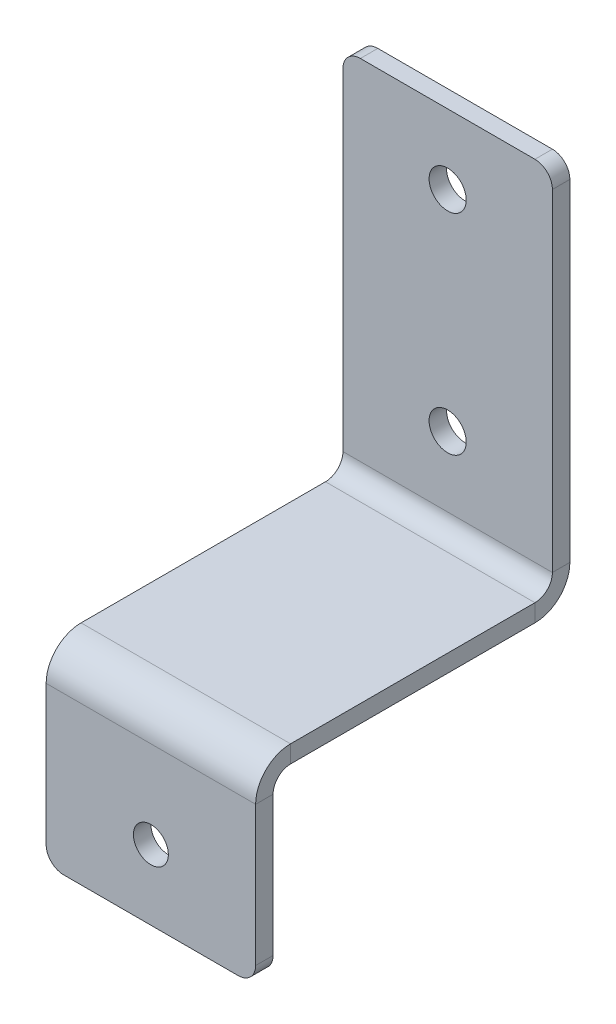
ISO-10303-21;
HEADER;
FILE_DESCRIPTION(('STEP AP214'),'2;1');
FILE_NAME('part.step','',(''),(''),'','','');
FILE_SCHEMA(('AUTOMOTIVE_DESIGN { 1 0 10303 214 1 1 1 1 }'));
ENDSEC;
DATA;
#1=APPLICATION_CONTEXT('core data for automotive mechanical design processes');
#2=APPLICATION_PROTOCOL_DEFINITION('international standard','automotive_design',2000,#1);
#3=PRODUCT_CONTEXT('',#1,'mechanical');
#4=PRODUCT('Part','Part','',(#3));
#5=PRODUCT_RELATED_PRODUCT_CATEGORY('part','',(#4));
#6=PRODUCT_DEFINITION_FORMATION('','',#4);
#7=PRODUCT_DEFINITION_CONTEXT('part definition',#1,'design');
#8=PRODUCT_DEFINITION('design','',#6,#7);
#9=PRODUCT_DEFINITION_SHAPE('','',#8);
#10=(LENGTH_UNIT() NAMED_UNIT(*) SI_UNIT(.MILLI.,.METRE.));
#11=(NAMED_UNIT(*) PLANE_ANGLE_UNIT() SI_UNIT($,.RADIAN.));
#12=(NAMED_UNIT(*) SI_UNIT($,.STERADIAN.) SOLID_ANGLE_UNIT());
#13=UNCERTAINTY_MEASURE_WITH_UNIT(LENGTH_MEASURE(1.E-05),#10,'distance_accuracy_value','');
#14=(GEOMETRIC_REPRESENTATION_CONTEXT(3) GLOBAL_UNCERTAINTY_ASSIGNED_CONTEXT((#13)) GLOBAL_UNIT_ASSIGNED_CONTEXT((#10,
#11,#12)) REPRESENTATION_CONTEXT('',''));
#15=CARTESIAN_POINT('',(0.,0.,0.));
#16=DIRECTION('',(0.,0.,1.));
#17=DIRECTION('',(1.,0.,0.));
#18=AXIS2_PLACEMENT_3D('',#15,#16,#17);
#19=CARTESIAN_POINT('',(0.,-3.175,0.));
#20=DIRECTION('',(-1.,0.,0.));
#21=DIRECTION('',(0.,0.,1.));
#22=AXIS2_PLACEMENT_3D('',#19,#20,#21);
#23=PLANE('',#22);
#24=DIRECTION('',(0.,0.,1.));
#25=VECTOR('',#24,1.);
#26=CARTESIAN_POINT('',(0.,-3.175,0.));
#27=LINE('',#26,#25);
#28=CARTESIAN_POINT('',(0.,-3.17500000000003,-50.8));
#29=VERTEX_POINT('',#28);
#30=CARTESIAN_POINT('',(0.,-3.175,-6.34999999999999));
#31=VERTEX_POINT('',#30);
#32=EDGE_CURVE('E311',#29,#31,#27,.T.);
#33=ORIENTED_EDGE('',*,*,#32,.T.);
#34=DIRECTION('',(0.,1.,0.));
#35=VECTOR('',#34,1.);
#36=CARTESIAN_POINT('',(0.,-3.17499999999999,-6.34999999999999));
#37=LINE('',#36,#35);
#38=CARTESIAN_POINT('',(0.,0.,-6.34999999999999));
#39=VERTEX_POINT('',#38);
#40=EDGE_CURVE('E250',#31,#39,#37,.T.);
#41=ORIENTED_EDGE('',*,*,#40,.T.);
#42=DIRECTION('',(0.,0.,1.));
#43=VECTOR('',#42,1.);
#44=CARTESIAN_POINT('',(0.,0.,0.));
#45=LINE('',#44,#43);
#46=CARTESIAN_POINT('',(0.,0.,-50.8));
#47=VERTEX_POINT('',#46);
#48=EDGE_CURVE('E308',#47,#39,#45,.T.);
#49=ORIENTED_EDGE('',*,*,#48,.F.);
#50=DIRECTION('',(0.,-1.,0.));
#51=VECTOR('',#50,1.);
#52=CARTESIAN_POINT('',(0.,0.,-50.8));
#53=LINE('',#52,#51);
#54=EDGE_CURVE('E294',#47,#29,#53,.T.);
#55=ORIENTED_EDGE('',*,*,#54,.T.);
#56=EDGE_LOOP('',(#33,#41,#49,#55));
#57=FACE_BOUND('',#56,.T.);
#58=ADVANCED_FACE('F78',(#57),#23,.T.);
#59=CARTESIAN_POINT('',(0.,-3.175,0.));
#60=DIRECTION('',(0.,-1.,0.));
#61=DIRECTION('',(0.,0.,-1.));
#62=AXIS2_PLACEMENT_3D('',#59,#60,#61);
#63=PLANE('',#62);
#64=DIRECTION('',(0.,0.,-1.));
#65=VECTOR('',#64,1.);
#66=CARTESIAN_POINT('',(38.1,-3.175,0.));
#67=LINE('',#66,#65);
#68=CARTESIAN_POINT('',(38.1,-3.175,-6.34999999999998));
#69=VERTEX_POINT('',#68);
#70=CARTESIAN_POINT('',(38.1,-3.175,-50.8));
#71=VERTEX_POINT('',#70);
#72=EDGE_CURVE('E314',#69,#71,#67,.T.);
#73=ORIENTED_EDGE('',*,*,#72,.F.);
#74=DIRECTION('',(-1.,0.,0.));
#75=VECTOR('',#74,1.);
#76=CARTESIAN_POINT('',(0.,-3.17499999999999,-6.34999999999999));
#77=LINE('',#76,#75);
#78=EDGE_CURVE('E254',#31,#69,#77,.F.);
#79=ORIENTED_EDGE('',*,*,#78,.F.);
#80=ORIENTED_EDGE('',*,*,#32,.F.);
#81=DIRECTION('',(-1.,0.,0.));
#82=VECTOR('',#81,1.);
#83=CARTESIAN_POINT('',(0.,-3.17500000000003,-50.8));
#84=LINE('',#83,#82);
#85=EDGE_CURVE('E287',#29,#71,#84,.F.);
#86=ORIENTED_EDGE('',*,*,#85,.T.);
#87=EDGE_LOOP('',(#73,#79,#80,#86));
#88=FACE_BOUND('',#87,.T.);
#89=ADVANCED_FACE('F390',(#88),#63,.T.);
#90=CARTESIAN_POINT('',(0.,0.,0.));
#91=DIRECTION('',(0.,-1.,0.));
#92=DIRECTION('',(0.,0.,-1.));
#93=AXIS2_PLACEMENT_3D('',#90,#91,#92);
#94=PLANE('',#93);
#95=DIRECTION('',(-1.,0.,0.));
#96=VECTOR('',#95,1.);
#97=CARTESIAN_POINT('',(0.,0.,-6.34999999999999));
#98=LINE('',#97,#96);
#99=CARTESIAN_POINT('',(38.1,0.,-6.34999999999998));
#100=VERTEX_POINT('',#99);
#101=EDGE_CURVE('E202',#39,#100,#98,.F.);
#102=ORIENTED_EDGE('',*,*,#101,.T.);
#103=DIRECTION('',(0.,0.,-1.));
#104=VECTOR('',#103,1.);
#105=CARTESIAN_POINT('',(38.1,0.,0.));
#106=LINE('',#105,#104);
#107=CARTESIAN_POINT('',(38.1,0.,-50.8));
#108=VERTEX_POINT('',#107);
#109=EDGE_CURVE('E315',#100,#108,#106,.T.);
#110=ORIENTED_EDGE('',*,*,#109,.T.);
#111=DIRECTION('',(-1.,0.,0.));
#112=VECTOR('',#111,1.);
#113=CARTESIAN_POINT('',(0.,0.,-50.8));
#114=LINE('',#113,#112);
#115=EDGE_CURVE('E300',#47,#108,#114,.F.);
#116=ORIENTED_EDGE('',*,*,#115,.F.);
#117=ORIENTED_EDGE('',*,*,#48,.T.);
#118=EDGE_LOOP('',(#102,#110,#116,#117));
#119=FACE_BOUND('',#118,.T.);
#120=ADVANCED_FACE('F446',(#119),#94,.F.);
#121=CARTESIAN_POINT('',(38.1,-3.175,0.));
#122=DIRECTION('',(1.,0.,0.));
#123=DIRECTION('',(0.,0.,-1.));
#124=AXIS2_PLACEMENT_3D('',#121,#122,#123);
#125=PLANE('',#124);
#126=DIRECTION('',(0.,1.,0.));
#127=VECTOR('',#126,1.);
#128=CARTESIAN_POINT('',(38.1,-3.17499999999999,-6.34999999999998));
#129=LINE('',#128,#127);
#130=EDGE_CURVE('E258',#69,#100,#129,.T.);
#131=ORIENTED_EDGE('',*,*,#130,.F.);
#132=ORIENTED_EDGE('',*,*,#72,.T.);
#133=DIRECTION('',(0.,-1.,0.));
#134=VECTOR('',#133,1.);
#135=CARTESIAN_POINT('',(38.1,0.,-50.8));
#136=LINE('',#135,#134);
#137=EDGE_CURVE('E305',#108,#71,#136,.T.);
#138=ORIENTED_EDGE('',*,*,#137,.F.);
#139=ORIENTED_EDGE('',*,*,#109,.F.);
#140=EDGE_LOOP('',(#131,#132,#138,#139));
#141=FACE_BOUND('',#140,.T.);
#142=ADVANCED_FACE('F450',(#141),#125,.T.);
#143=CARTESIAN_POINT('',(38.1,3.17499999999997,-50.8));
#144=DIRECTION('',(1.,0.,0.));
#145=DIRECTION('',(0.,0.,-1.));
#146=AXIS2_PLACEMENT_3D('',#143,#144,#145);
#147=PLANE('',#146);
#148=DIRECTION('',(0.,0.,1.));
#149=VECTOR('',#148,1.);
#150=CARTESIAN_POINT('',(38.1,3.17500000000001,-57.15));
#151=LINE('',#150,#149);
#152=CARTESIAN_POINT('',(38.1,3.17499999999996,-53.975));
#153=VERTEX_POINT('',#152);
#154=CARTESIAN_POINT('',(38.1,3.17499999999995,-57.15));
#155=VERTEX_POINT('',#154);
#156=EDGE_CURVE('E261',#153,#155,#151,.F.);
#157=ORIENTED_EDGE('',*,*,#156,.F.);
#158=CARTESIAN_POINT('',(38.1,3.17499999999997,-50.8));
#159=DIRECTION('',(-1.,0.,0.));
#160=DIRECTION('',(0.,0.,1.));
#161=AXIS2_PLACEMENT_3D('',#158,#159,#160);
#162=CIRCLE('',#161,3.175);
#163=EDGE_CURVE('E297',#108,#153,#162,.F.);
#164=ORIENTED_EDGE('',*,*,#163,.F.);
#165=ORIENTED_EDGE('',*,*,#137,.T.);
#166=CARTESIAN_POINT('',(38.1,3.17499999999997,-50.8));
#167=DIRECTION('',(-1.,0.,0.));
#168=DIRECTION('',(0.,0.,1.));
#169=AXIS2_PLACEMENT_3D('',#166,#167,#168);
#170=CIRCLE('',#169,6.35);
#171=EDGE_CURVE('E290',#71,#155,#170,.F.);
#172=ORIENTED_EDGE('',*,*,#171,.T.);
#173=EDGE_LOOP('',(#157,#164,#165,#172));
#174=FACE_BOUND('',#173,.T.);
#175=ADVANCED_FACE('F383',(#174),#147,.T.);
#176=CARTESIAN_POINT('',(0.,3.17499999999997,-50.8));
#177=DIRECTION('',(1.,0.,0.));
#178=DIRECTION('',(0.,0.,-1.));
#179=AXIS2_PLACEMENT_3D('',#176,#177,#178);
#180=PLANE('',#179);
#181=CARTESIAN_POINT('',(0.,3.17499999999997,-50.8));
#182=DIRECTION('',(-1.,0.,0.));
#183=DIRECTION('',(0.,0.,1.));
#184=AXIS2_PLACEMENT_3D('',#181,#182,#183);
#185=CIRCLE('',#184,3.175);
#186=CARTESIAN_POINT('',(0.,3.17499999999996,-53.975));
#187=VERTEX_POINT('',#186);
#188=EDGE_CURVE('E266',#187,#47,#185,.T.);
#189=ORIENTED_EDGE('',*,*,#188,.F.);
#190=DIRECTION('',(0.,0.,1.));
#191=VECTOR('',#190,1.);
#192=CARTESIAN_POINT('',(0.,3.17499999999999,-53.975));
#193=LINE('',#192,#191);
#194=CARTESIAN_POINT('',(0.,3.17500000000001,-57.15));
#195=VERTEX_POINT('',#194);
#196=EDGE_CURVE('E280',#187,#195,#193,.F.);
#197=ORIENTED_EDGE('',*,*,#196,.T.);
#198=CARTESIAN_POINT('',(0.,3.17499999999997,-50.8));
#199=DIRECTION('',(-1.,0.,0.));
#200=DIRECTION('',(0.,0.,1.));
#201=AXIS2_PLACEMENT_3D('',#198,#199,#200);
#202=CIRCLE('',#201,6.35);
#203=EDGE_CURVE('E291',#195,#29,#202,.T.);
#204=ORIENTED_EDGE('',*,*,#203,.T.);
#205=ORIENTED_EDGE('',*,*,#54,.F.);
#206=EDGE_LOOP('',(#189,#197,#204,#205));
#207=FACE_BOUND('',#206,.T.);
#208=ADVANCED_FACE('F378',(#207),#180,.F.);
#209=CARTESIAN_POINT('',(0.,3.17499999999997,-50.8));
#210=DIRECTION('',(-1.,0.,0.));
#211=DIRECTION('',(0.,0.,-1.));
#212=AXIS2_PLACEMENT_3D('',#209,#210,#211);
#213=CYLINDRICAL_SURFACE('',#212,6.35);
#214=ORIENTED_EDGE('',*,*,#85,.F.);
#215=ORIENTED_EDGE('',*,*,#203,.F.);
#216=DIRECTION('',(-1.,0.,0.));
#217=VECTOR('',#216,1.);
#218=CARTESIAN_POINT('',(38.1,3.17500000000001,-57.15));
#219=LINE('',#218,#217);
#220=EDGE_CURVE('E277',#195,#155,#219,.F.);
#221=ORIENTED_EDGE('',*,*,#220,.T.);
#222=ORIENTED_EDGE('',*,*,#171,.F.);
#223=EDGE_LOOP('',(#214,#215,#221,#222));
#224=FACE_BOUND('',#223,.T.);
#225=ADVANCED_FACE('F381',(#224),#213,.T.);
#226=CARTESIAN_POINT('',(0.,3.17499999999997,-50.8));
#227=DIRECTION('',(-1.,0.,0.));
#228=DIRECTION('',(0.,0.,-1.));
#229=AXIS2_PLACEMENT_3D('',#226,#227,#228);
#230=CYLINDRICAL_SURFACE('',#229,3.175);
#231=ORIENTED_EDGE('',*,*,#115,.T.);
#232=ORIENTED_EDGE('',*,*,#163,.T.);
#233=DIRECTION('',(-1.,0.,0.));
#234=VECTOR('',#233,1.);
#235=CARTESIAN_POINT('',(38.1,3.17499999999999,-53.975));
#236=LINE('',#235,#234);
#237=EDGE_CURVE('E283',#153,#187,#236,.T.);
#238=ORIENTED_EDGE('',*,*,#237,.T.);
#239=ORIENTED_EDGE('',*,*,#188,.T.);
#240=EDGE_LOOP('',(#231,#232,#238,#239));
#241=FACE_BOUND('',#240,.T.);
#242=ADVANCED_FACE('F575',(#241),#230,.F.);
#243=CARTESIAN_POINT('',(38.1,0.,-57.15));
#244=DIRECTION('',(-1.,0.,0.));
#245=DIRECTION('',(0.,0.,1.));
#246=AXIS2_PLACEMENT_3D('',#243,#244,#245);
#247=PLANE('',#246);
#248=DIRECTION('',(0.,-1.,0.));
#249=VECTOR('',#248,1.);
#250=CARTESIAN_POINT('',(38.1,-2.13304647021838E-13,-57.15));
#251=LINE('',#250,#249);
#252=CARTESIAN_POINT('',(38.1,63.5,-57.1500000000002));
#253=VERTEX_POINT('',#252);
#254=EDGE_CURVE('E269',#253,#155,#251,.T.);
#255=ORIENTED_EDGE('',*,*,#254,.F.);
#256=DIRECTION('',(0.,0.,1.));
#257=VECTOR('',#256,1.);
#258=CARTESIAN_POINT('',(38.1,63.5,-57.1500000000002));
#259=LINE('',#258,#257);
#260=CARTESIAN_POINT('',(38.1,63.5,-53.9750000000002));
#261=VERTEX_POINT('',#260);
#262=EDGE_CURVE('E341',#253,#261,#259,.T.);
#263=ORIENTED_EDGE('',*,*,#262,.T.);
#264=DIRECTION('',(0.,1.,0.));
#265=VECTOR('',#264,1.);
#266=CARTESIAN_POINT('',(38.1,0.,-53.975));
#267=LINE('',#266,#265);
#268=EDGE_CURVE('E275',#261,#153,#267,.F.);
#269=ORIENTED_EDGE('',*,*,#268,.T.);
#270=ORIENTED_EDGE('',*,*,#156,.T.);
#271=EDGE_LOOP('',(#255,#263,#269,#270));
#272=FACE_BOUND('',#271,.T.);
#273=ADVANCED_FACE('F361',(#272),#247,.F.);
#274=CARTESIAN_POINT('',(0.,66.675,-57.1500000000002));
#275=DIRECTION('',(1.,0.,0.));
#276=DIRECTION('',(0.,0.,-1.));
#277=AXIS2_PLACEMENT_3D('',#274,#275,#276);
#278=PLANE('',#277);
#279=DIRECTION('',(0.,-1.,0.));
#280=VECTOR('',#279,1.);
#281=CARTESIAN_POINT('',(0.,66.675,-53.9750000000002));
#282=LINE('',#281,#280);
#283=CARTESIAN_POINT('',(0.,63.5,-53.9750000000002));
#284=VERTEX_POINT('',#283);
#285=EDGE_CURVE('E273',#187,#284,#282,.F.);
#286=ORIENTED_EDGE('',*,*,#285,.T.);
#287=DIRECTION('',(0.,0.,1.));
#288=VECTOR('',#287,1.);
#289=CARTESIAN_POINT('',(0.,63.5,-57.1500000000002));
#290=LINE('',#289,#288);
#291=CARTESIAN_POINT('',(0.,63.5,-57.1500000000002));
#292=VERTEX_POINT('',#291);
#293=EDGE_CURVE('E13',#284,#292,#290,.F.);
#294=ORIENTED_EDGE('',*,*,#293,.T.);
#295=DIRECTION('',(0.,1.,0.));
#296=VECTOR('',#295,1.);
#297=CARTESIAN_POINT('',(0.,-2.13304647021838E-13,-57.15));
#298=LINE('',#297,#296);
#299=EDGE_CURVE('E267',#195,#292,#298,.T.);
#300=ORIENTED_EDGE('',*,*,#299,.F.);
#301=ORIENTED_EDGE('',*,*,#196,.F.);
#302=EDGE_LOOP('',(#286,#294,#300,#301));
#303=FACE_BOUND('',#302,.T.);
#304=ADVANCED_FACE('F375',(#303),#278,.F.);
#305=CARTESIAN_POINT('',(0.,-2.13304647021838E-13,-57.15));
#306=DIRECTION('',(0.,0.,1.));
#307=DIRECTION('',(0.,-1.,0.));
#308=AXIS2_PLACEMENT_3D('',#305,#306,#307);
#309=PLANE('',#308);
#310=CARTESIAN_POINT('',(19.05,53.975,-57.1500000000002));
#311=DIRECTION('',(0.,0.,1.));
#312=DIRECTION('',(1.,0.,0.));
#313=AXIS2_PLACEMENT_3D('',#310,#311,#312);
#314=CIRCLE('',#313,3.37819999999999);
#315=CARTESIAN_POINT('',(22.4282,53.975,-57.1500000000002));
#316=VERTEX_POINT('',#315);
#317=EDGE_CURVE('E421',#316,#316,#314,.T.);
#318=ORIENTED_EDGE('',*,*,#317,.T.);
#319=EDGE_LOOP('',(#318));
#320=FACE_BOUND('',#319,.T.);
#321=CARTESIAN_POINT('',(19.05,15.875,-57.1500000000002));
#322=DIRECTION('',(0.,0.,1.));
#323=DIRECTION('',(1.,0.,0.));
#324=AXIS2_PLACEMENT_3D('',#321,#322,#323);
#325=CIRCLE('',#324,3.37819999999999);
#326=CARTESIAN_POINT('',(22.4282,15.875,-57.1500000000002));
#327=VERTEX_POINT('',#326);
#328=EDGE_CURVE('E247',#327,#327,#325,.T.);
#329=ORIENTED_EDGE('',*,*,#328,.T.);
#330=EDGE_LOOP('',(#329));
#331=FACE_BOUND('',#330,.T.);
#332=DIRECTION('',(1.,0.,0.));
#333=VECTOR('',#332,1.);
#334=CARTESIAN_POINT('',(0.,66.675,-57.1500000000002));
#335=LINE('',#334,#333);
#336=CARTESIAN_POINT('',(3.175,66.675,-57.1500000000002));
#337=VERTEX_POINT('',#336);
#338=CARTESIAN_POINT('',(34.925,66.675,-57.1500000000002));
#339=VERTEX_POINT('',#338);
#340=EDGE_CURVE('E264',#337,#339,#335,.T.);
#341=ORIENTED_EDGE('',*,*,#340,.T.);
#342=CARTESIAN_POINT('',(34.925,63.5,-57.1500000000002));
#343=DIRECTION('',(0.,0.,1.));
#344=DIRECTION('',(0.,-1.,0.));
#345=AXIS2_PLACEMENT_3D('',#342,#343,#344);
#346=CIRCLE('',#345,3.175);
#347=EDGE_CURVE('E86',#339,#253,#346,.F.);
#348=ORIENTED_EDGE('',*,*,#347,.T.);
#349=ORIENTED_EDGE('',*,*,#254,.T.);
#350=ORIENTED_EDGE('',*,*,#220,.F.);
#351=ORIENTED_EDGE('',*,*,#299,.T.);
#352=CARTESIAN_POINT('',(3.175,63.5,-57.1500000000002));
#353=DIRECTION('',(0.,0.,1.));
#354=DIRECTION('',(0.,-1.,0.));
#355=AXIS2_PLACEMENT_3D('',#352,#353,#354);
#356=CIRCLE('',#355,3.175);
#357=EDGE_CURVE('E352',#292,#337,#356,.F.);
#358=ORIENTED_EDGE('',*,*,#357,.T.);
#359=EDGE_LOOP('',(#341,#348,#349,#350,#351,#358));
#360=FACE_BOUND('',#359,.T.);
#361=ADVANCED_FACE('F356',(#320,#331,#360),#309,.F.);
#362=CARTESIAN_POINT('',(0.,-2.02219193771011E-13,-53.975));
#363=DIRECTION('',(0.,0.,1.));
#364=DIRECTION('',(0.,-1.,0.));
#365=AXIS2_PLACEMENT_3D('',#362,#363,#364);
#366=PLANE('',#365);
#367=CARTESIAN_POINT('',(19.05,53.975,-53.975));
#368=DIRECTION('',(0.,0.,1.));
#369=DIRECTION('',(1.,0.,0.));
#370=AXIS2_PLACEMENT_3D('',#367,#368,#369);
#371=CIRCLE('',#370,3.37819999999999);
#372=CARTESIAN_POINT('',(22.4282,53.975,-53.975));
#373=VERTEX_POINT('',#372);
#374=EDGE_CURVE('E323',#373,#373,#371,.T.);
#375=ORIENTED_EDGE('',*,*,#374,.F.);
#376=EDGE_LOOP('',(#375));
#377=FACE_BOUND('',#376,.T.);
#378=CARTESIAN_POINT('',(19.05,15.875,-53.975));
#379=DIRECTION('',(0.,0.,1.));
#380=DIRECTION('',(1.,0.,0.));
#381=AXIS2_PLACEMENT_3D('',#378,#379,#380);
#382=CIRCLE('',#381,3.37819999999999);
#383=CARTESIAN_POINT('',(22.4282,15.875,-53.975));
#384=VERTEX_POINT('',#383);
#385=EDGE_CURVE('E418',#384,#384,#382,.T.);
#386=ORIENTED_EDGE('',*,*,#385,.F.);
#387=EDGE_LOOP('',(#386));
#388=FACE_BOUND('',#387,.T.);
#389=ORIENTED_EDGE('',*,*,#268,.F.);
#390=CARTESIAN_POINT('',(34.925,63.5,-53.9750000000002));
#391=DIRECTION('',(0.,0.,1.));
#392=DIRECTION('',(0.,-1.,0.));
#393=AXIS2_PLACEMENT_3D('',#390,#391,#392);
#394=CIRCLE('',#393,3.175);
#395=CARTESIAN_POINT('',(34.925,66.675,-53.9750000000002));
#396=VERTEX_POINT('',#395);
#397=EDGE_CURVE('E346',#261,#396,#394,.T.);
#398=ORIENTED_EDGE('',*,*,#397,.T.);
#399=DIRECTION('',(-1.,0.,0.));
#400=VECTOR('',#399,1.);
#401=CARTESIAN_POINT('',(38.1,66.675,-53.9750000000002));
#402=LINE('',#401,#400);
#403=CARTESIAN_POINT('',(3.175,66.675,-53.9750000000002));
#404=VERTEX_POINT('',#403);
#405=EDGE_CURVE('E271',#404,#396,#402,.F.);
#406=ORIENTED_EDGE('',*,*,#405,.F.);
#407=CARTESIAN_POINT('',(3.175,63.5,-53.9750000000002));
#408=DIRECTION('',(0.,0.,1.));
#409=DIRECTION('',(0.,-1.,0.));
#410=AXIS2_PLACEMENT_3D('',#407,#408,#409);
#411=CIRCLE('',#410,3.175);
#412=EDGE_CURVE('E344',#404,#284,#411,.T.);
#413=ORIENTED_EDGE('',*,*,#412,.T.);
#414=ORIENTED_EDGE('',*,*,#285,.F.);
#415=ORIENTED_EDGE('',*,*,#237,.F.);
#416=EDGE_LOOP('',(#389,#398,#406,#413,#414,#415));
#417=FACE_BOUND('',#416,.T.);
#418=ADVANCED_FACE('F367',(#377,#388,#417),#366,.T.);
#419=CARTESIAN_POINT('',(38.1,66.675,-57.1500000000002));
#420=DIRECTION('',(0.,-1.,0.));
#421=DIRECTION('',(0.,0.,-1.));
#422=AXIS2_PLACEMENT_3D('',#419,#420,#421);
#423=PLANE('',#422);
#424=ORIENTED_EDGE('',*,*,#405,.T.);
#425=DIRECTION('',(0.,0.,1.));
#426=VECTOR('',#425,1.);
#427=CARTESIAN_POINT('',(34.925,66.675,-57.1500000000002));
#428=LINE('',#427,#426);
#429=EDGE_CURVE('E99',#396,#339,#428,.F.);
#430=ORIENTED_EDGE('',*,*,#429,.T.);
#431=ORIENTED_EDGE('',*,*,#340,.F.);
#432=DIRECTION('',(0.,0.,1.));
#433=VECTOR('',#432,1.);
#434=CARTESIAN_POINT('',(3.175,66.675,-57.1500000000002));
#435=LINE('',#434,#433);
#436=EDGE_CURVE('E348',#337,#404,#435,.T.);
#437=ORIENTED_EDGE('',*,*,#436,.T.);
#438=EDGE_LOOP('',(#424,#430,#431,#437));
#439=FACE_BOUND('',#438,.T.);
#440=ADVANCED_FACE('F369',(#439),#423,.F.);
#441=CARTESIAN_POINT('',(38.1,-6.34999999999999,-6.34999999999999));
#442=DIRECTION('',(1.,0.,0.));
#443=DIRECTION('',(0.,0.,-1.));
#444=AXIS2_PLACEMENT_3D('',#441,#442,#443);
#445=PLANE('',#444);
#446=DIRECTION('',(0.,0.,-1.));
#447=VECTOR('',#446,1.);
#448=CARTESIAN_POINT('',(38.1,-6.34999999999999,0.));
#449=LINE('',#448,#447);
#450=CARTESIAN_POINT('',(38.1,-6.34999999999998,-3.17499999999999));
#451=VERTEX_POINT('',#450);
#452=CARTESIAN_POINT('',(38.1,-6.34999999999997,0.));
#453=VERTEX_POINT('',#452);
#454=EDGE_CURVE('E244',#451,#453,#449,.F.);
#455=ORIENTED_EDGE('',*,*,#454,.F.);
#456=CARTESIAN_POINT('',(38.1,-6.34999999999999,-6.34999999999999));
#457=DIRECTION('',(-1.,0.,0.));
#458=DIRECTION('',(0.,0.,1.));
#459=AXIS2_PLACEMENT_3D('',#456,#457,#458);
#460=CIRCLE('',#459,3.175);
#461=EDGE_CURVE('E205',#69,#451,#460,.F.);
#462=ORIENTED_EDGE('',*,*,#461,.F.);
#463=ORIENTED_EDGE('',*,*,#130,.T.);
#464=CARTESIAN_POINT('',(38.1,-6.34999999999999,-6.34999999999999));
#465=DIRECTION('',(-1.,0.,0.));
#466=DIRECTION('',(0.,0.,1.));
#467=AXIS2_PLACEMENT_3D('',#464,#465,#466);
#468=CIRCLE('',#467,6.35);
#469=EDGE_CURVE('E249',#100,#453,#468,.F.);
#470=ORIENTED_EDGE('',*,*,#469,.T.);
#471=EDGE_LOOP('',(#455,#462,#463,#470));
#472=FACE_BOUND('',#471,.T.);
#473=ADVANCED_FACE('F534',(#472),#445,.T.);
#474=CARTESIAN_POINT('',(0.,-6.34999999999999,-6.34999999999999));
#475=DIRECTION('',(1.,0.,0.));
#476=DIRECTION('',(0.,0.,-1.));
#477=AXIS2_PLACEMENT_3D('',#474,#475,#476);
#478=PLANE('',#477);
#479=CARTESIAN_POINT('',(0.,-6.34999999999999,-6.34999999999999));
#480=DIRECTION('',(-1.,0.,0.));
#481=DIRECTION('',(0.,0.,1.));
#482=AXIS2_PLACEMENT_3D('',#479,#480,#481);
#483=CIRCLE('',#482,3.175);
#484=CARTESIAN_POINT('',(0.,-6.34999999999998,-3.17499999999999));
#485=VERTEX_POINT('',#484);
#486=EDGE_CURVE('E212',#485,#31,#483,.T.);
#487=ORIENTED_EDGE('',*,*,#486,.F.);
#488=DIRECTION('',(0.,0.,-1.));
#489=VECTOR('',#488,1.);
#490=CARTESIAN_POINT('',(0.,-6.34999999999999,-3.17499999999999));
#491=LINE('',#490,#489);
#492=CARTESIAN_POINT('',(0.,-6.34999999999999,0.));
#493=VERTEX_POINT('',#492);
#494=EDGE_CURVE('E209',#485,#493,#491,.F.);
#495=ORIENTED_EDGE('',*,*,#494,.T.);
#496=CARTESIAN_POINT('',(0.,-6.34999999999999,-6.34999999999999));
#497=DIRECTION('',(-1.,0.,0.));
#498=DIRECTION('',(0.,0.,1.));
#499=AXIS2_PLACEMENT_3D('',#496,#497,#498);
#500=CIRCLE('',#499,6.35);
#501=EDGE_CURVE('E194',#493,#39,#500,.T.);
#502=ORIENTED_EDGE('',*,*,#501,.T.);
#503=ORIENTED_EDGE('',*,*,#40,.F.);
#504=EDGE_LOOP('',(#487,#495,#502,#503));
#505=FACE_BOUND('',#504,.T.);
#506=ADVANCED_FACE('F210',(#505),#478,.F.);
#507=CARTESIAN_POINT('',(0.,-6.34999999999999,-6.34999999999999));
#508=DIRECTION('',(-1.,0.,0.));
#509=DIRECTION('',(0.,0.,1.));
#510=AXIS2_PLACEMENT_3D('',#507,#508,#509);
#511=CYLINDRICAL_SURFACE('',#510,6.35);
#512=ORIENTED_EDGE('',*,*,#101,.F.);
#513=ORIENTED_EDGE('',*,*,#501,.F.);
#514=DIRECTION('',(-1.,0.,0.));
#515=VECTOR('',#514,1.);
#516=CARTESIAN_POINT('',(38.1,-6.34999999999999,0.));
#517=LINE('',#516,#515);
#518=EDGE_CURVE('E199',#493,#453,#517,.F.);
#519=ORIENTED_EDGE('',*,*,#518,.T.);
#520=ORIENTED_EDGE('',*,*,#469,.F.);
#521=EDGE_LOOP('',(#512,#513,#519,#520));
#522=FACE_BOUND('',#521,.T.);
#523=ADVANCED_FACE('F196',(#522),#511,.T.);
#524=CARTESIAN_POINT('',(0.,-6.34999999999999,-6.34999999999999));
#525=DIRECTION('',(-1.,0.,0.));
#526=DIRECTION('',(0.,0.,1.));
#527=AXIS2_PLACEMENT_3D('',#524,#525,#526);
#528=CYLINDRICAL_SURFACE('',#527,3.175);
#529=ORIENTED_EDGE('',*,*,#78,.T.);
#530=ORIENTED_EDGE('',*,*,#461,.T.);
#531=DIRECTION('',(-1.,0.,0.));
#532=VECTOR('',#531,1.);
#533=CARTESIAN_POINT('',(38.1,-6.34999999999999,-3.17499999999999));
#534=LINE('',#533,#532);
#535=EDGE_CURVE('E217',#451,#485,#534,.T.);
#536=ORIENTED_EDGE('',*,*,#535,.T.);
#537=ORIENTED_EDGE('',*,*,#486,.T.);
#538=EDGE_LOOP('',(#529,#530,#536,#537));
#539=FACE_BOUND('',#538,.T.);
#540=ADVANCED_FACE('F394',(#539),#528,.F.);
#541=CARTESIAN_POINT('',(0.,-34.925,1.11022302462516E-13));
#542=DIRECTION('',(1.,0.,0.));
#543=DIRECTION('',(0.,0.,-1.));
#544=AXIS2_PLACEMENT_3D('',#541,#542,#543);
#545=PLANE('',#544);
#546=DIRECTION('',(0.,1.,0.));
#547=VECTOR('',#546,1.);
#548=CARTESIAN_POINT('',(0.,-34.925,-3.17499999999989));
#549=LINE('',#548,#547);
#550=CARTESIAN_POINT('',(0.,-31.75,-3.1749999999999));
#551=VERTEX_POINT('',#550);
#552=EDGE_CURVE('E227',#485,#551,#549,.F.);
#553=ORIENTED_EDGE('',*,*,#552,.T.);
#554=DIRECTION('',(0.,0.,-1.));
#555=VECTOR('',#554,1.);
#556=CARTESIAN_POINT('',(0.,-31.75,0.));
#557=LINE('',#556,#555);
#558=CARTESIAN_POINT('',(0.,-31.75,0.));
#559=VERTEX_POINT('',#558);
#560=EDGE_CURVE('E231',#551,#559,#557,.F.);
#561=ORIENTED_EDGE('',*,*,#560,.T.);
#562=DIRECTION('',(0.,-1.,0.));
#563=VECTOR('',#562,1.);
#564=CARTESIAN_POINT('',(0.,0.,0.));
#565=LINE('',#564,#563);
#566=EDGE_CURVE('E223',#493,#559,#565,.T.);
#567=ORIENTED_EDGE('',*,*,#566,.F.);
#568=ORIENTED_EDGE('',*,*,#494,.F.);
#569=EDGE_LOOP('',(#553,#561,#567,#568));
#570=FACE_BOUND('',#569,.T.);
#571=ADVANCED_FACE('F229',(#570),#545,.F.);
#572=CARTESIAN_POINT('',(38.1,-3.17499999999999,0.));
#573=DIRECTION('',(-1.,0.,0.));
#574=DIRECTION('',(0.,0.,1.));
#575=AXIS2_PLACEMENT_3D('',#572,#573,#574);
#576=PLANE('',#575);
#577=DIRECTION('',(0.,1.,0.));
#578=VECTOR('',#577,1.);
#579=CARTESIAN_POINT('',(38.1,0.,0.));
#580=LINE('',#579,#578);
#581=CARTESIAN_POINT('',(38.1,-31.75,0.));
#582=VERTEX_POINT('',#581);
#583=EDGE_CURVE('E226',#582,#453,#580,.T.);
#584=ORIENTED_EDGE('',*,*,#583,.F.);
#585=DIRECTION('',(0.,0.,-1.));
#586=VECTOR('',#585,1.);
#587=CARTESIAN_POINT('',(38.1,-31.75,0.));
#588=LINE('',#587,#586);
#589=CARTESIAN_POINT('',(38.1,-31.75,-3.1749999999999));
#590=VERTEX_POINT('',#589);
#591=EDGE_CURVE('E317',#582,#590,#588,.T.);
#592=ORIENTED_EDGE('',*,*,#591,.T.);
#593=DIRECTION('',(0.,-1.,0.));
#594=VECTOR('',#593,1.);
#595=CARTESIAN_POINT('',(38.1,-3.175,-3.175));
#596=LINE('',#595,#594);
#597=EDGE_CURVE('E233',#590,#451,#596,.F.);
#598=ORIENTED_EDGE('',*,*,#597,.T.);
#599=ORIENTED_EDGE('',*,*,#454,.T.);
#600=EDGE_LOOP('',(#584,#592,#598,#599));
#601=FACE_BOUND('',#600,.T.);
#602=ADVANCED_FACE('F413',(#601),#576,.F.);
#603=CARTESIAN_POINT('',(0.,0.,0.));
#604=DIRECTION('',(0.,0.,-1.));
#605=DIRECTION('',(0.,1.,0.));
#606=AXIS2_PLACEMENT_3D('',#603,#604,#605);
#607=PLANE('',#606);
#608=CARTESIAN_POINT('',(19.05,-22.225,0.));
#609=DIRECTION('',(0.,0.,1.));
#610=DIRECTION('',(1.,0.,0.));
#611=AXIS2_PLACEMENT_3D('',#608,#609,#610);
#612=CIRCLE('',#611,3.17499999999999);
#613=CARTESIAN_POINT('',(22.225,-22.225,0.));
#614=VERTEX_POINT('',#613);
#615=EDGE_CURVE('E324',#614,#614,#612,.T.);
#616=ORIENTED_EDGE('',*,*,#615,.F.);
#617=EDGE_LOOP('',(#616));
#618=FACE_BOUND('',#617,.T.);
#619=DIRECTION('',(1.,0.,0.));
#620=VECTOR('',#619,1.);
#621=CARTESIAN_POINT('',(0.,-34.925,1.10664283165247E-13));
#622=LINE('',#621,#620);
#623=CARTESIAN_POINT('',(3.175,-34.925,1.10664283165247E-13));
#624=VERTEX_POINT('',#623);
#625=CARTESIAN_POINT('',(34.925,-34.925,1.10664283165247E-13));
#626=VERTEX_POINT('',#625);
#627=EDGE_CURVE('E232',#624,#626,#622,.T.);
#628=ORIENTED_EDGE('',*,*,#627,.T.);
#629=CARTESIAN_POINT('',(34.925,-31.75,0.));
#630=DIRECTION('',(0.,0.,-1.));
#631=DIRECTION('',(0.,1.,0.));
#632=AXIS2_PLACEMENT_3D('',#629,#630,#631);
#633=CIRCLE('',#632,3.175);
#634=EDGE_CURVE('E338',#626,#582,#633,.F.);
#635=ORIENTED_EDGE('',*,*,#634,.T.);
#636=ORIENTED_EDGE('',*,*,#583,.T.);
#637=ORIENTED_EDGE('',*,*,#518,.F.);
#638=ORIENTED_EDGE('',*,*,#566,.T.);
#639=CARTESIAN_POINT('',(3.175,-31.75,0.));
#640=DIRECTION('',(0.,0.,-1.));
#641=DIRECTION('',(0.,1.,0.));
#642=AXIS2_PLACEMENT_3D('',#639,#640,#641);
#643=CIRCLE('',#642,3.175);
#644=EDGE_CURVE('E336',#559,#624,#643,.F.);
#645=ORIENTED_EDGE('',*,*,#644,.T.);
#646=EDGE_LOOP('',(#628,#635,#636,#637,#638,#645));
#647=FACE_BOUND('',#646,.T.);
#648=ADVANCED_FACE('F222',(#618,#647),#607,.F.);
#649=CARTESIAN_POINT('',(0.,0.,-3.17500000000001));
#650=DIRECTION('',(0.,0.,-1.));
#651=DIRECTION('',(0.,1.,0.));
#652=AXIS2_PLACEMENT_3D('',#649,#650,#651);
#653=PLANE('',#652);
#654=CARTESIAN_POINT('',(19.05,-22.225,-3.17499999999993));
#655=DIRECTION('',(0.,0.,-1.));
#656=DIRECTION('',(0.,1.,0.));
#657=AXIS2_PLACEMENT_3D('',#654,#655,#656);
#658=CIRCLE('',#657,3.17499999999999);
#659=CARTESIAN_POINT('',(19.05,-19.05,-3.17499999999994));
#660=VERTEX_POINT('',#659);
#661=EDGE_CURVE('E320',#660,#660,#658,.T.);
#662=ORIENTED_EDGE('',*,*,#661,.F.);
#663=EDGE_LOOP('',(#662));
#664=FACE_BOUND('',#663,.T.);
#665=ORIENTED_EDGE('',*,*,#597,.F.);
#666=CARTESIAN_POINT('',(34.925,-31.75,-3.1749999999999));
#667=DIRECTION('',(0.,0.,-1.));
#668=DIRECTION('',(0.,1.,0.));
#669=AXIS2_PLACEMENT_3D('',#666,#667,#668);
#670=CIRCLE('',#669,3.175);
#671=CARTESIAN_POINT('',(34.925,-34.925,-3.17499999999989));
#672=VERTEX_POINT('',#671);
#673=EDGE_CURVE('E329',#590,#672,#670,.T.);
#674=ORIENTED_EDGE('',*,*,#673,.T.);
#675=DIRECTION('',(-1.,0.,0.));
#676=VECTOR('',#675,1.);
#677=CARTESIAN_POINT('',(38.1,-34.925,-3.17499999999989));
#678=LINE('',#677,#676);
#679=CARTESIAN_POINT('',(3.175,-34.925,-3.17499999999989));
#680=VERTEX_POINT('',#679);
#681=EDGE_CURVE('E236',#680,#672,#678,.F.);
#682=ORIENTED_EDGE('',*,*,#681,.F.);
#683=CARTESIAN_POINT('',(3.175,-31.75,-3.1749999999999));
#684=DIRECTION('',(0.,0.,-1.));
#685=DIRECTION('',(0.,1.,0.));
#686=AXIS2_PLACEMENT_3D('',#683,#684,#685);
#687=CIRCLE('',#686,3.175);
#688=EDGE_CURVE('E327',#680,#551,#687,.T.);
#689=ORIENTED_EDGE('',*,*,#688,.T.);
#690=ORIENTED_EDGE('',*,*,#552,.F.);
#691=ORIENTED_EDGE('',*,*,#535,.F.);
#692=EDGE_LOOP('',(#665,#674,#682,#689,#690,#691));
#693=FACE_BOUND('',#692,.T.);
#694=ADVANCED_FACE('F399',(#664,#693),#653,.T.);
#695=CARTESIAN_POINT('',(38.1,-34.925,1.11022302462516E-13));
#696=DIRECTION('',(0.,1.,0.));
#697=DIRECTION('',(0.,0.,1.));
#698=AXIS2_PLACEMENT_3D('',#695,#696,#697);
#699=PLANE('',#698);
#700=ORIENTED_EDGE('',*,*,#681,.T.);
#701=DIRECTION('',(0.,0.,-1.));
#702=VECTOR('',#701,1.);
#703=CARTESIAN_POINT('',(34.925,-34.925,1.11022302462516E-13));
#704=LINE('',#703,#702);
#705=EDGE_CURVE('E334',#672,#626,#704,.F.);
#706=ORIENTED_EDGE('',*,*,#705,.T.);
#707=ORIENTED_EDGE('',*,*,#627,.F.);
#708=DIRECTION('',(0.,0.,-1.));
#709=VECTOR('',#708,1.);
#710=CARTESIAN_POINT('',(3.175,-34.925,1.11022302462516E-13));
#711=LINE('',#710,#709);
#712=EDGE_CURVE('E331',#624,#680,#711,.T.);
#713=ORIENTED_EDGE('',*,*,#712,.T.);
#714=EDGE_LOOP('',(#700,#706,#707,#713));
#715=FACE_BOUND('',#714,.T.);
#716=ADVANCED_FACE('F407',(#715),#699,.F.);
#717=CARTESIAN_POINT('',(19.05,15.875,-53.975));
#718=DIRECTION('',(0.,0.,1.));
#719=DIRECTION('',(1.,0.,0.));
#720=AXIS2_PLACEMENT_3D('',#717,#718,#719);
#721=CYLINDRICAL_SURFACE('',#720,3.37819999999999);
#722=ORIENTED_EDGE('',*,*,#328,.F.);
#723=EDGE_LOOP('',(#722));
#724=FACE_BOUND('',#723,.T.);
#725=ORIENTED_EDGE('',*,*,#385,.T.);
#726=EDGE_LOOP('',(#725));
#727=FACE_BOUND('',#726,.T.);
#728=ADVANCED_FACE('F492',(#724,#727),#721,.F.);
#729=CARTESIAN_POINT('',(19.05,53.975,-53.975));
#730=DIRECTION('',(0.,0.,1.));
#731=DIRECTION('',(1.,0.,0.));
#732=AXIS2_PLACEMENT_3D('',#729,#730,#731);
#733=CYLINDRICAL_SURFACE('',#732,3.37819999999999);
#734=ORIENTED_EDGE('',*,*,#317,.F.);
#735=EDGE_LOOP('',(#734));
#736=FACE_BOUND('',#735,.T.);
#737=ORIENTED_EDGE('',*,*,#374,.T.);
#738=EDGE_LOOP('',(#737));
#739=FACE_BOUND('',#738,.T.);
#740=ADVANCED_FACE('F585',(#736,#739),#733,.F.);
#741=CARTESIAN_POINT('',(19.05,-22.225,0.));
#742=DIRECTION('',(0.,0.,1.));
#743=DIRECTION('',(1.,0.,0.));
#744=AXIS2_PLACEMENT_3D('',#741,#742,#743);
#745=CYLINDRICAL_SURFACE('',#744,3.17499999999999);
#746=ORIENTED_EDGE('',*,*,#661,.T.);
#747=EDGE_LOOP('',(#746));
#748=FACE_BOUND('',#747,.T.);
#749=ORIENTED_EDGE('',*,*,#615,.T.);
#750=EDGE_LOOP('',(#749));
#751=FACE_BOUND('',#750,.T.);
#752=ADVANCED_FACE('F429',(#748,#751),#745,.F.);
#753=CARTESIAN_POINT('',(34.925,-31.75,0.));
#754=DIRECTION('',(0.,0.,-1.));
#755=DIRECTION('',(0.,1.,0.));
#756=AXIS2_PLACEMENT_3D('',#753,#754,#755);
#757=CYLINDRICAL_SURFACE('',#756,3.175);
#758=ORIENTED_EDGE('',*,*,#634,.F.);
#759=ORIENTED_EDGE('',*,*,#705,.F.);
#760=ORIENTED_EDGE('',*,*,#673,.F.);
#761=ORIENTED_EDGE('',*,*,#591,.F.);
#762=EDGE_LOOP('',(#758,#759,#760,#761));
#763=FACE_BOUND('',#762,.T.);
#764=ADVANCED_FACE('F410',(#763),#757,.T.);
#765=CARTESIAN_POINT('',(3.175,-31.75,0.));
#766=DIRECTION('',(0.,0.,-1.));
#767=DIRECTION('',(0.,1.,0.));
#768=AXIS2_PLACEMENT_3D('',#765,#766,#767);
#769=CYLINDRICAL_SURFACE('',#768,3.175);
#770=ORIENTED_EDGE('',*,*,#644,.F.);
#771=ORIENTED_EDGE('',*,*,#560,.F.);
#772=ORIENTED_EDGE('',*,*,#688,.F.);
#773=ORIENTED_EDGE('',*,*,#712,.F.);
#774=EDGE_LOOP('',(#770,#771,#772,#773));
#775=FACE_BOUND('',#774,.T.);
#776=ADVANCED_FACE('F402',(#775),#769,.T.);
#777=CARTESIAN_POINT('',(34.925,63.5,-57.1500000000002));
#778=DIRECTION('',(0.,0.,1.));
#779=DIRECTION('',(0.,-1.,0.));
#780=AXIS2_PLACEMENT_3D('',#777,#778,#779);
#781=CYLINDRICAL_SURFACE('',#780,3.175);
#782=ORIENTED_EDGE('',*,*,#347,.F.);
#783=ORIENTED_EDGE('',*,*,#429,.F.);
#784=ORIENTED_EDGE('',*,*,#397,.F.);
#785=ORIENTED_EDGE('',*,*,#262,.F.);
#786=EDGE_LOOP('',(#782,#783,#784,#785));
#787=FACE_BOUND('',#786,.T.);
#788=ADVANCED_FACE('F364',(#787),#781,.T.);
#789=CARTESIAN_POINT('',(3.175,63.5,-57.1500000000002));
#790=DIRECTION('',(0.,0.,1.));
#791=DIRECTION('',(0.,-1.,0.));
#792=AXIS2_PLACEMENT_3D('',#789,#790,#791);
#793=CYLINDRICAL_SURFACE('',#792,3.175);
#794=ORIENTED_EDGE('',*,*,#357,.F.);
#795=ORIENTED_EDGE('',*,*,#293,.F.);
#796=ORIENTED_EDGE('',*,*,#412,.F.);
#797=ORIENTED_EDGE('',*,*,#436,.F.);
#798=EDGE_LOOP('',(#794,#795,#796,#797));
#799=FACE_BOUND('',#798,.T.);
#800=ADVANCED_FACE('F80',(#799),#793,.T.);
#801=CLOSED_SHELL('',(#58,#89,#120,#142,#175,#208,#225,#242,#273,#304,#361,#418,#440,#473,#506,
#523,#540,#571,#602,#648,#694,#716,#728,#740,#752,#764,#776,#788,#800));
#802=MANIFOLD_SOLID_BREP('B2',#801);
#803=ADVANCED_BREP_SHAPE_REPRESENTATION('',(#18,#802),#14);
#804=SHAPE_DEFINITION_REPRESENTATION(#9,#803);
ENDSEC;
END-ISO-10303-21;
